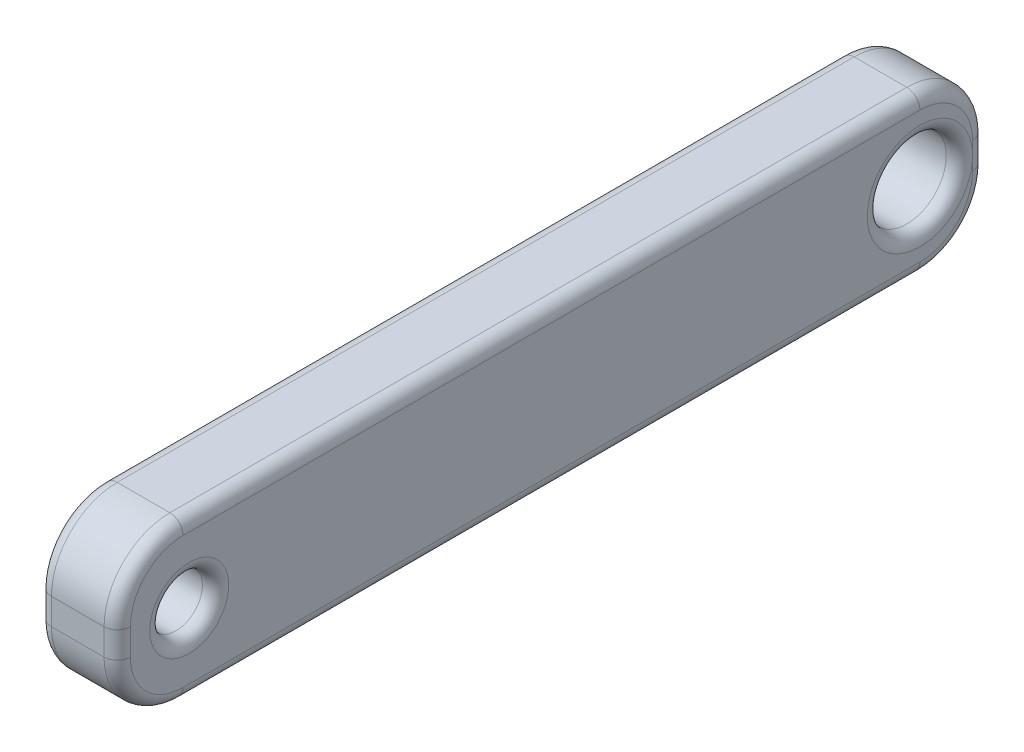
ISO-10303-21;
HEADER;
FILE_DESCRIPTION(('STEP AP214'),'2;1');
FILE_NAME('part.step','',(''),(''),'','','');
FILE_SCHEMA(('AUTOMOTIVE_DESIGN { 1 0 10303 214 1 1 1 1 }'));
ENDSEC;
DATA;
#1=APPLICATION_CONTEXT('core data for automotive mechanical design processes');
#2=APPLICATION_PROTOCOL_DEFINITION('international standard','automotive_design',2000,#1);
#3=PRODUCT_CONTEXT('',#1,'mechanical');
#4=PRODUCT('Part','Part','',(#3));
#5=PRODUCT_RELATED_PRODUCT_CATEGORY('part','',(#4));
#6=PRODUCT_DEFINITION_FORMATION('','',#4);
#7=PRODUCT_DEFINITION_CONTEXT('part definition',#1,'design');
#8=PRODUCT_DEFINITION('design','',#6,#7);
#9=PRODUCT_DEFINITION_SHAPE('','',#8);
#10=(LENGTH_UNIT() NAMED_UNIT(*) SI_UNIT(.MILLI.,.METRE.));
#11=(NAMED_UNIT(*) PLANE_ANGLE_UNIT() SI_UNIT($,.RADIAN.));
#12=(NAMED_UNIT(*) SI_UNIT($,.STERADIAN.) SOLID_ANGLE_UNIT());
#13=UNCERTAINTY_MEASURE_WITH_UNIT(LENGTH_MEASURE(1.E-05),#10,'distance_accuracy_value','');
#14=(GEOMETRIC_REPRESENTATION_CONTEXT(3) GLOBAL_UNCERTAINTY_ASSIGNED_CONTEXT((#13)) GLOBAL_UNIT_ASSIGNED_CONTEXT((#10,
#11,#12)) REPRESENTATION_CONTEXT('',''));
#15=CARTESIAN_POINT('',(0.,0.,0.));
#16=DIRECTION('',(0.,0.,1.));
#17=DIRECTION('',(1.,0.,0.));
#18=AXIS2_PLACEMENT_3D('',#15,#16,#17);
#19=CARTESIAN_POINT('',(3.,3.5,-30.5));
#20=DIRECTION('',(1.,0.,0.));
#21=DIRECTION('',(0.,0.,-1.));
#22=AXIS2_PLACEMENT_3D('',#19,#20,#21);
#23=PLANE('',#22);
#24=CARTESIAN_POINT('',(3.,3.,-2.73587532026645));
#25=DIRECTION('',(1.,0.,0.));
#26=DIRECTION('',(0.,0.,-1.));
#27=AXIS2_PLACEMENT_3D('',#24,#25,#26);
#28=CIRCLE('',#27,1.5);
#29=CARTESIAN_POINT('',(3.,3.,-4.23587532026645));
#30=VERTEX_POINT('',#29);
#31=EDGE_CURVE('E11',#30,#30,#28,.F.);
#32=ORIENTED_EDGE('',*,*,#31,.T.);
#33=EDGE_LOOP('',(#32));
#34=FACE_BOUND('',#33,.T.);
#35=CARTESIAN_POINT('',(3.,2.5,-30.5));
#36=DIRECTION('',(1.,0.,0.));
#37=DIRECTION('',(0.,0.,-1.));
#38=AXIS2_PLACEMENT_3D('',#35,#36,#37);
#39=CIRCLE('',#38,2.);
#40=CARTESIAN_POINT('',(3.,0.5,-30.5));
#41=VERTEX_POINT('',#40);
#42=CARTESIAN_POINT('',(3.,2.5,-32.5));
#43=VERTEX_POINT('',#42);
#44=EDGE_CURVE('E50',#41,#43,#39,.T.);
#45=ORIENTED_EDGE('',*,*,#44,.T.);
#46=DIRECTION('',(0.,1.,0.));
#47=VECTOR('',#46,1.);
#48=CARTESIAN_POINT('',(3.,3.5,-32.5));
#49=LINE('',#48,#47);
#50=CARTESIAN_POINT('',(3.,3.,-32.5));
#51=VERTEX_POINT('',#50);
#52=EDGE_CURVE('E42',#43,#51,#49,.T.);
#53=ORIENTED_EDGE('',*,*,#52,.T.);
#54=CARTESIAN_POINT('',(3.,3.,-30.5));
#55=DIRECTION('',(1.,0.,0.));
#56=DIRECTION('',(0.,0.,-1.));
#57=AXIS2_PLACEMENT_3D('',#54,#55,#56);
#58=CIRCLE('',#57,2.);
#59=EDGE_CURVE('E248',#51,#51,#58,.F.);
#60=ORIENTED_EDGE('',*,*,#59,.T.);
#61=DIRECTION('',(0.,1.,0.));
#62=VECTOR('',#61,1.);
#63=CARTESIAN_POINT('',(3.,3.5,-32.5));
#64=LINE('',#63,#62);
#65=CARTESIAN_POINT('',(3.,3.5,-32.5));
#66=VERTEX_POINT('',#65);
#67=EDGE_CURVE('E251',#51,#66,#64,.T.);
#68=ORIENTED_EDGE('',*,*,#67,.T.);
#69=CARTESIAN_POINT('',(3.,3.5,-30.5));
#70=DIRECTION('',(1.,0.,0.));
#71=DIRECTION('',(0.,0.,-1.));
#72=AXIS2_PLACEMENT_3D('',#69,#70,#71);
#73=CIRCLE('',#72,2.);
#74=CARTESIAN_POINT('',(3.,5.5,-30.5));
#75=VERTEX_POINT('',#74);
#76=EDGE_CURVE('E253',#66,#75,#73,.T.);
#77=ORIENTED_EDGE('',*,*,#76,.T.);
#78=DIRECTION('',(0.,0.,1.));
#79=VECTOR('',#78,1.);
#80=CARTESIAN_POINT('',(3.,5.5,-2.50000000000002));
#81=LINE('',#80,#79);
#82=CARTESIAN_POINT('',(3.,5.5,-2.50000000000001));
#83=VERTEX_POINT('',#82);
#84=EDGE_CURVE('E255',#75,#83,#81,.T.);
#85=ORIENTED_EDGE('',*,*,#84,.T.);
#86=CARTESIAN_POINT('',(3.,3.5,-2.5));
#87=DIRECTION('',(1.,0.,0.));
#88=DIRECTION('',(0.,0.,-1.));
#89=AXIS2_PLACEMENT_3D('',#86,#87,#88);
#90=CIRCLE('',#89,2.);
#91=CARTESIAN_POINT('',(3.,3.49999999999998,-0.5));
#92=VERTEX_POINT('',#91);
#93=EDGE_CURVE('E257',#83,#92,#90,.T.);
#94=ORIENTED_EDGE('',*,*,#93,.T.);
#95=DIRECTION('',(0.,-1.,0.));
#96=VECTOR('',#95,1.);
#97=CARTESIAN_POINT('',(3.,2.50000000000002,-0.5));
#98=LINE('',#97,#96);
#99=CARTESIAN_POINT('',(3.,2.50000000000001,-0.5));
#100=VERTEX_POINT('',#99);
#101=EDGE_CURVE('E259',#92,#100,#98,.T.);
#102=ORIENTED_EDGE('',*,*,#101,.T.);
#103=CARTESIAN_POINT('',(3.,2.5,-2.5));
#104=DIRECTION('',(1.,0.,0.));
#105=DIRECTION('',(0.,0.,-1.));
#106=AXIS2_PLACEMENT_3D('',#103,#104,#105);
#107=CIRCLE('',#106,2.);
#108=CARTESIAN_POINT('',(3.,0.5,-2.50000000000002));
#109=VERTEX_POINT('',#108);
#110=EDGE_CURVE('E261',#100,#109,#107,.T.);
#111=ORIENTED_EDGE('',*,*,#110,.T.);
#112=DIRECTION('',(0.,0.,-1.));
#113=VECTOR('',#112,1.);
#114=CARTESIAN_POINT('',(3.,0.5,-30.5));
#115=LINE('',#114,#113);
#116=EDGE_CURVE('E55',#109,#41,#115,.T.);
#117=ORIENTED_EDGE('',*,*,#116,.T.);
#118=EDGE_LOOP('',(#45,#53,#60,#68,#77,#85,#94,#102,#111,#117));
#119=FACE_BOUND('',#118,.T.);
#120=ADVANCED_FACE('F33',(#34,#119),#23,.T.);
#121=CARTESIAN_POINT('',(0.,3.5,-30.5));
#122=DIRECTION('',(1.,0.,0.));
#123=DIRECTION('',(0.,0.,-1.));
#124=AXIS2_PLACEMENT_3D('',#121,#122,#123);
#125=PLANE('',#124);
#126=CARTESIAN_POINT('',(0.,3.,-2.73587532026645));
#127=DIRECTION('',(1.,0.,0.));
#128=DIRECTION('',(0.,0.,-1.));
#129=AXIS2_PLACEMENT_3D('',#126,#127,#128);
#130=CIRCLE('',#129,1.5);
#131=CARTESIAN_POINT('',(0.,3.,-4.23587532026645));
#132=VERTEX_POINT('',#131);
#133=EDGE_CURVE('E175',#132,#132,#130,.T.);
#134=ORIENTED_EDGE('',*,*,#133,.T.);
#135=EDGE_LOOP('',(#134));
#136=FACE_BOUND('',#135,.T.);
#137=CARTESIAN_POINT('',(0.,3.5,-30.5));
#138=DIRECTION('',(1.,0.,0.));
#139=DIRECTION('',(0.,0.,-1.));
#140=AXIS2_PLACEMENT_3D('',#137,#138,#139);
#141=CIRCLE('',#140,2.);
#142=CARTESIAN_POINT('',(0.,5.5,-30.5));
#143=VERTEX_POINT('',#142);
#144=CARTESIAN_POINT('',(0.,3.5,-32.5));
#145=VERTEX_POINT('',#144);
#146=EDGE_CURVE('E170',#143,#145,#141,.F.);
#147=ORIENTED_EDGE('',*,*,#146,.T.);
#148=DIRECTION('',(0.,1.,0.));
#149=VECTOR('',#148,1.);
#150=CARTESIAN_POINT('',(0.,3.5,-32.5));
#151=LINE('',#150,#149);
#152=CARTESIAN_POINT('',(0.,3.,-32.5));
#153=VERTEX_POINT('',#152);
#154=EDGE_CURVE('E166',#145,#153,#151,.F.);
#155=ORIENTED_EDGE('',*,*,#154,.T.);
#156=CARTESIAN_POINT('',(0.,3.,-30.5));
#157=DIRECTION('',(1.,0.,0.));
#158=DIRECTION('',(0.,0.,-1.));
#159=AXIS2_PLACEMENT_3D('',#156,#157,#158);
#160=CIRCLE('',#159,2.);
#161=CARTESIAN_POINT('',(0.,3.,-28.5));
#162=VERTEX_POINT('',#161);
#163=EDGE_CURVE('E156',#153,#162,#160,.T.);
#164=ORIENTED_EDGE('',*,*,#163,.T.);
#165=CARTESIAN_POINT('',(0.,3.,-30.5));
#166=DIRECTION('',(1.,0.,0.));
#167=DIRECTION('',(0.,0.,-1.));
#168=AXIS2_PLACEMENT_3D('',#165,#166,#167);
#169=CIRCLE('',#168,2.);
#170=EDGE_CURVE('E161',#162,#153,#169,.T.);
#171=ORIENTED_EDGE('',*,*,#170,.T.);
#172=DIRECTION('',(0.,1.,0.));
#173=VECTOR('',#172,1.);
#174=CARTESIAN_POINT('',(0.,3.5,-32.5));
#175=LINE('',#174,#173);
#176=CARTESIAN_POINT('',(0.,2.5,-32.5));
#177=VERTEX_POINT('',#176);
#178=EDGE_CURVE('E177',#153,#177,#175,.F.);
#179=ORIENTED_EDGE('',*,*,#178,.T.);
#180=CARTESIAN_POINT('',(0.,2.5,-30.5));
#181=DIRECTION('',(1.,0.,0.));
#182=DIRECTION('',(0.,0.,-1.));
#183=AXIS2_PLACEMENT_3D('',#180,#181,#182);
#184=CIRCLE('',#183,2.);
#185=CARTESIAN_POINT('',(0.,0.499999999999999,-30.5));
#186=VERTEX_POINT('',#185);
#187=EDGE_CURVE('E185',#177,#186,#184,.F.);
#188=ORIENTED_EDGE('',*,*,#187,.T.);
#189=DIRECTION('',(0.,0.,-1.));
#190=VECTOR('',#189,1.);
#191=CARTESIAN_POINT('',(0.,0.5,-30.5));
#192=LINE('',#191,#190);
#193=CARTESIAN_POINT('',(0.,0.5,-2.50000000000001));
#194=VERTEX_POINT('',#193);
#195=EDGE_CURVE('E187',#186,#194,#192,.F.);
#196=ORIENTED_EDGE('',*,*,#195,.T.);
#197=CARTESIAN_POINT('',(0.,2.5,-2.5));
#198=DIRECTION('',(1.,0.,0.));
#199=DIRECTION('',(0.,0.,-1.));
#200=AXIS2_PLACEMENT_3D('',#197,#198,#199);
#201=CIRCLE('',#200,2.);
#202=CARTESIAN_POINT('',(0.,2.50000000000002,-0.5));
#203=VERTEX_POINT('',#202);
#204=EDGE_CURVE('E191',#194,#203,#201,.F.);
#205=ORIENTED_EDGE('',*,*,#204,.T.);
#206=DIRECTION('',(0.,-1.,0.));
#207=VECTOR('',#206,1.);
#208=CARTESIAN_POINT('',(0.,3.5,-0.5));
#209=LINE('',#208,#207);
#210=CARTESIAN_POINT('',(0.,3.49999999999999,-0.5));
#211=VERTEX_POINT('',#210);
#212=EDGE_CURVE('E193',#203,#211,#209,.F.);
#213=ORIENTED_EDGE('',*,*,#212,.T.);
#214=CARTESIAN_POINT('',(0.,3.5,-2.5));
#215=DIRECTION('',(1.,0.,0.));
#216=DIRECTION('',(0.,0.,-1.));
#217=AXIS2_PLACEMENT_3D('',#214,#215,#216);
#218=CIRCLE('',#217,2.);
#219=CARTESIAN_POINT('',(0.,5.5,-2.50000000000002));
#220=VERTEX_POINT('',#219);
#221=EDGE_CURVE('E195',#211,#220,#218,.F.);
#222=ORIENTED_EDGE('',*,*,#221,.T.);
#223=DIRECTION('',(0.,0.,1.));
#224=VECTOR('',#223,1.);
#225=CARTESIAN_POINT('',(0.,5.5,-30.5));
#226=LINE('',#225,#224);
#227=EDGE_CURVE('E197',#220,#143,#226,.F.);
#228=ORIENTED_EDGE('',*,*,#227,.T.);
#229=EDGE_LOOP('',(#147,#155,#164,#171,#179,#188,#196,#205,#213,#222,#228));
#230=FACE_BOUND('',#229,.T.);
#231=ADVANCED_FACE('F167',(#136,#230),#125,.F.);
#232=CARTESIAN_POINT('',(3.,3.5,-30.5));
#233=DIRECTION('',(-1.,0.,0.));
#234=DIRECTION('',(0.,0.,1.));
#235=AXIS2_PLACEMENT_3D('',#232,#233,#234);
#236=CYLINDRICAL_SURFACE('',#235,2.5);
#237=DIRECTION('',(-1.,0.,0.));
#238=VECTOR('',#237,1.);
#239=CARTESIAN_POINT('',(3.,3.5,-33.));
#240=LINE('',#239,#238);
#241=CARTESIAN_POINT('',(2.5,3.5,-33.));
#242=VERTEX_POINT('',#241);
#243=CARTESIAN_POINT('',(0.5,3.5,-33.));
#244=VERTEX_POINT('',#243);
#245=EDGE_CURVE('E285',#242,#244,#240,.T.);
#246=ORIENTED_EDGE('',*,*,#245,.T.);
#247=CARTESIAN_POINT('',(0.5,3.5,-30.5));
#248=DIRECTION('',(1.,0.,0.));
#249=DIRECTION('',(0.,0.,-1.));
#250=AXIS2_PLACEMENT_3D('',#247,#248,#249);
#251=CIRCLE('',#250,2.5);
#252=CARTESIAN_POINT('',(0.5,6.,-30.5));
#253=VERTEX_POINT('',#252);
#254=EDGE_CURVE('E240',#244,#253,#251,.T.);
#255=ORIENTED_EDGE('',*,*,#254,.T.);
#256=DIRECTION('',(-1.,0.,0.));
#257=VECTOR('',#256,1.);
#258=CARTESIAN_POINT('',(3.,6.,-30.5));
#259=LINE('',#258,#257);
#260=CARTESIAN_POINT('',(2.5,6.,-30.5));
#261=VERTEX_POINT('',#260);
#262=EDGE_CURVE('E163',#261,#253,#259,.T.);
#263=ORIENTED_EDGE('',*,*,#262,.F.);
#264=CARTESIAN_POINT('',(2.5,3.5,-30.5));
#265=DIRECTION('',(1.,0.,0.));
#266=DIRECTION('',(0.,0.,-1.));
#267=AXIS2_PLACEMENT_3D('',#264,#265,#266);
#268=CIRCLE('',#267,2.5);
#269=EDGE_CURVE('E238',#261,#242,#268,.F.);
#270=ORIENTED_EDGE('',*,*,#269,.T.);
#271=EDGE_LOOP('',(#246,#255,#263,#270));
#272=FACE_BOUND('',#271,.T.);
#273=ADVANCED_FACE('F396',(#272),#236,.T.);
#274=CARTESIAN_POINT('',(3.,6.,-2.50000000000002));
#275=DIRECTION('',(0.,-1.,0.));
#276=DIRECTION('',(0.,0.,-1.));
#277=AXIS2_PLACEMENT_3D('',#274,#275,#276);
#278=PLANE('',#277);
#279=ORIENTED_EDGE('',*,*,#262,.T.);
#280=DIRECTION('',(0.,0.,1.));
#281=VECTOR('',#280,1.);
#282=CARTESIAN_POINT('',(0.5,6.,-2.50000000000002));
#283=LINE('',#282,#281);
#284=CARTESIAN_POINT('',(0.5,6.,-2.50000000000002));
#285=VERTEX_POINT('',#284);
#286=EDGE_CURVE('E210',#253,#285,#283,.T.);
#287=ORIENTED_EDGE('',*,*,#286,.T.);
#288=DIRECTION('',(-1.,0.,0.));
#289=VECTOR('',#288,1.);
#290=CARTESIAN_POINT('',(3.,6.,-2.50000000000002));
#291=LINE('',#290,#289);
#292=CARTESIAN_POINT('',(2.5,6.,-2.50000000000002));
#293=VERTEX_POINT('',#292);
#294=EDGE_CURVE('E333',#293,#285,#291,.T.);
#295=ORIENTED_EDGE('',*,*,#294,.F.);
#296=DIRECTION('',(0.,0.,1.));
#297=VECTOR('',#296,1.);
#298=CARTESIAN_POINT('',(2.5,6.,-30.5));
#299=LINE('',#298,#297);
#300=EDGE_CURVE('E208',#293,#261,#299,.F.);
#301=ORIENTED_EDGE('',*,*,#300,.T.);
#302=EDGE_LOOP('',(#279,#287,#295,#301));
#303=FACE_BOUND('',#302,.T.);
#304=ADVANCED_FACE('F344',(#303),#278,.F.);
#305=CARTESIAN_POINT('',(3.,3.5,-2.5));
#306=DIRECTION('',(-1.,0.,0.));
#307=DIRECTION('',(0.,0.,1.));
#308=AXIS2_PLACEMENT_3D('',#305,#306,#307);
#309=CYLINDRICAL_SURFACE('',#308,2.5);
#310=ORIENTED_EDGE('',*,*,#294,.T.);
#311=CARTESIAN_POINT('',(0.5,3.5,-2.5));
#312=DIRECTION('',(1.,0.,0.));
#313=DIRECTION('',(0.,0.,-1.));
#314=AXIS2_PLACEMENT_3D('',#311,#312,#313);
#315=CIRCLE('',#314,2.5);
#316=CARTESIAN_POINT('',(0.5,3.49999999999998,0.));
#317=VERTEX_POINT('',#316);
#318=EDGE_CURVE('E215',#285,#317,#315,.T.);
#319=ORIENTED_EDGE('',*,*,#318,.T.);
#320=DIRECTION('',(-1.,0.,0.));
#321=VECTOR('',#320,1.);
#322=CARTESIAN_POINT('',(3.,3.49999999999998,0.));
#323=LINE('',#322,#321);
#324=CARTESIAN_POINT('',(2.5,3.49999999999998,0.));
#325=VERTEX_POINT('',#324);
#326=EDGE_CURVE('E324',#325,#317,#323,.T.);
#327=ORIENTED_EDGE('',*,*,#326,.F.);
#328=CARTESIAN_POINT('',(2.5,3.5,-2.5));
#329=DIRECTION('',(1.,0.,0.));
#330=DIRECTION('',(0.,0.,-1.));
#331=AXIS2_PLACEMENT_3D('',#328,#329,#330);
#332=CIRCLE('',#331,2.5);
#333=EDGE_CURVE('E213',#325,#293,#332,.F.);
#334=ORIENTED_EDGE('',*,*,#333,.T.);
#335=EDGE_LOOP('',(#310,#319,#327,#334));
#336=FACE_BOUND('',#335,.T.);
#337=ADVANCED_FACE('F330',(#336),#309,.T.);
#338=CARTESIAN_POINT('',(3.,2.50000000000002,0.));
#339=DIRECTION('',(0.,0.,-1.));
#340=DIRECTION('',(-1.,0.,0.));
#341=AXIS2_PLACEMENT_3D('',#338,#339,#340);
#342=PLANE('',#341);
#343=ORIENTED_EDGE('',*,*,#326,.T.);
#344=DIRECTION('',(0.,-1.,0.));
#345=VECTOR('',#344,1.);
#346=CARTESIAN_POINT('',(0.5,2.50000000000002,0.));
#347=LINE('',#346,#345);
#348=CARTESIAN_POINT('',(0.5,2.50000000000002,0.));
#349=VERTEX_POINT('',#348);
#350=EDGE_CURVE('E219',#317,#349,#347,.T.);
#351=ORIENTED_EDGE('',*,*,#350,.T.);
#352=DIRECTION('',(-1.,0.,0.));
#353=VECTOR('',#352,1.);
#354=CARTESIAN_POINT('',(3.,2.50000000000002,0.));
#355=LINE('',#354,#353);
#356=CARTESIAN_POINT('',(2.5,2.50000000000002,0.));
#357=VERTEX_POINT('',#356);
#358=EDGE_CURVE('E327',#357,#349,#355,.T.);
#359=ORIENTED_EDGE('',*,*,#358,.F.);
#360=DIRECTION('',(0.,-1.,0.));
#361=VECTOR('',#360,1.);
#362=CARTESIAN_POINT('',(2.5,3.49999999999998,0.));
#363=LINE('',#362,#361);
#364=EDGE_CURVE('E217',#357,#325,#363,.F.);
#365=ORIENTED_EDGE('',*,*,#364,.T.);
#366=EDGE_LOOP('',(#343,#351,#359,#365));
#367=FACE_BOUND('',#366,.T.);
#368=ADVANCED_FACE('F323',(#367),#342,.F.);
#369=CARTESIAN_POINT('',(3.,2.5,-2.5));
#370=DIRECTION('',(-1.,0.,0.));
#371=DIRECTION('',(0.,0.,1.));
#372=AXIS2_PLACEMENT_3D('',#369,#370,#371);
#373=CYLINDRICAL_SURFACE('',#372,2.5);
#374=ORIENTED_EDGE('',*,*,#358,.T.);
#375=CARTESIAN_POINT('',(0.5,2.5,-2.5));
#376=DIRECTION('',(1.,0.,0.));
#377=DIRECTION('',(0.,0.,-1.));
#378=AXIS2_PLACEMENT_3D('',#375,#376,#377);
#379=CIRCLE('',#378,2.5);
#380=CARTESIAN_POINT('',(0.5,0.,-2.50000000000002));
#381=VERTEX_POINT('',#380);
#382=EDGE_CURVE('E223',#349,#381,#379,.T.);
#383=ORIENTED_EDGE('',*,*,#382,.T.);
#384=DIRECTION('',(-1.,0.,0.));
#385=VECTOR('',#384,1.);
#386=CARTESIAN_POINT('',(3.,0.,-2.50000000000002));
#387=LINE('',#386,#385);
#388=CARTESIAN_POINT('',(2.5,0.,-2.50000000000002));
#389=VERTEX_POINT('',#388);
#390=EDGE_CURVE('E336',#389,#381,#387,.T.);
#391=ORIENTED_EDGE('',*,*,#390,.F.);
#392=CARTESIAN_POINT('',(2.5,2.5,-2.5));
#393=DIRECTION('',(1.,0.,0.));
#394=DIRECTION('',(0.,0.,-1.));
#395=AXIS2_PLACEMENT_3D('',#392,#393,#394);
#396=CIRCLE('',#395,2.5);
#397=EDGE_CURVE('E221',#389,#357,#396,.F.);
#398=ORIENTED_EDGE('',*,*,#397,.T.);
#399=EDGE_LOOP('',(#374,#383,#391,#398));
#400=FACE_BOUND('',#399,.T.);
#401=ADVANCED_FACE('F366',(#400),#373,.T.);
#402=CARTESIAN_POINT('',(3.,0.,-2.50000000000002));
#403=DIRECTION('',(0.,1.,0.));
#404=DIRECTION('',(0.,0.,1.));
#405=AXIS2_PLACEMENT_3D('',#402,#403,#404);
#406=PLANE('',#405);
#407=ORIENTED_EDGE('',*,*,#390,.T.);
#408=DIRECTION('',(0.,0.,-1.));
#409=VECTOR('',#408,1.);
#410=CARTESIAN_POINT('',(0.5,0.,-2.50000000000002));
#411=LINE('',#410,#409);
#412=CARTESIAN_POINT('',(0.5,0.,-30.5));
#413=VERTEX_POINT('',#412);
#414=EDGE_CURVE('E227',#381,#413,#411,.T.);
#415=ORIENTED_EDGE('',*,*,#414,.T.);
#416=DIRECTION('',(-1.,0.,0.));
#417=VECTOR('',#416,1.);
#418=CARTESIAN_POINT('',(3.,0.,-30.5));
#419=LINE('',#418,#417);
#420=CARTESIAN_POINT('',(2.5,0.,-30.5));
#421=VERTEX_POINT('',#420);
#422=EDGE_CURVE('E383',#421,#413,#419,.T.);
#423=ORIENTED_EDGE('',*,*,#422,.F.);
#424=DIRECTION('',(0.,0.,-1.));
#425=VECTOR('',#424,1.);
#426=CARTESIAN_POINT('',(2.5,0.,-2.50000000000002));
#427=LINE('',#426,#425);
#428=EDGE_CURVE('E225',#421,#389,#427,.F.);
#429=ORIENTED_EDGE('',*,*,#428,.T.);
#430=EDGE_LOOP('',(#407,#415,#423,#429));
#431=FACE_BOUND('',#430,.T.);
#432=ADVANCED_FACE('F382',(#431),#406,.F.);
#433=CARTESIAN_POINT('',(3.,2.5,-30.5));
#434=DIRECTION('',(-1.,0.,0.));
#435=DIRECTION('',(0.,0.,1.));
#436=AXIS2_PLACEMENT_3D('',#433,#434,#435);
#437=CYLINDRICAL_SURFACE('',#436,2.5);
#438=ORIENTED_EDGE('',*,*,#422,.T.);
#439=CARTESIAN_POINT('',(0.5,2.5,-30.5));
#440=DIRECTION('',(1.,0.,0.));
#441=DIRECTION('',(0.,0.,-1.));
#442=AXIS2_PLACEMENT_3D('',#439,#440,#441);
#443=CIRCLE('',#442,2.5);
#444=CARTESIAN_POINT('',(0.5,2.5,-33.));
#445=VERTEX_POINT('',#444);
#446=EDGE_CURVE('E231',#413,#445,#443,.T.);
#447=ORIENTED_EDGE('',*,*,#446,.T.);
#448=DIRECTION('',(-1.,0.,0.));
#449=VECTOR('',#448,1.);
#450=CARTESIAN_POINT('',(3.,2.5,-33.));
#451=LINE('',#450,#449);
#452=CARTESIAN_POINT('',(2.5,2.5,-33.));
#453=VERTEX_POINT('',#452);
#454=EDGE_CURVE('E390',#453,#445,#451,.T.);
#455=ORIENTED_EDGE('',*,*,#454,.F.);
#456=CARTESIAN_POINT('',(2.5,2.5,-30.5));
#457=DIRECTION('',(1.,0.,0.));
#458=DIRECTION('',(0.,0.,-1.));
#459=AXIS2_PLACEMENT_3D('',#456,#457,#458);
#460=CIRCLE('',#459,2.5);
#461=EDGE_CURVE('E229',#453,#421,#460,.F.);
#462=ORIENTED_EDGE('',*,*,#461,.T.);
#463=EDGE_LOOP('',(#438,#447,#455,#462));
#464=FACE_BOUND('',#463,.T.);
#465=ADVANCED_FACE('F386',(#464),#437,.T.);
#466=CARTESIAN_POINT('',(3.,2.5,-33.));
#467=DIRECTION('',(0.,0.,1.));
#468=DIRECTION('',(1.,0.,0.));
#469=AXIS2_PLACEMENT_3D('',#466,#467,#468);
#470=PLANE('',#469);
#471=ORIENTED_EDGE('',*,*,#454,.T.);
#472=DIRECTION('',(0.,1.,0.));
#473=VECTOR('',#472,1.);
#474=CARTESIAN_POINT('',(0.5,2.5,-33.));
#475=LINE('',#474,#473);
#476=EDGE_CURVE('E236',#445,#244,#475,.T.);
#477=ORIENTED_EDGE('',*,*,#476,.T.);
#478=ORIENTED_EDGE('',*,*,#245,.F.);
#479=DIRECTION('',(0.,1.,0.));
#480=VECTOR('',#479,1.);
#481=CARTESIAN_POINT('',(2.5,2.5,-33.));
#482=LINE('',#481,#480);
#483=EDGE_CURVE('E233',#242,#453,#482,.F.);
#484=ORIENTED_EDGE('',*,*,#483,.T.);
#485=EDGE_LOOP('',(#471,#477,#478,#484));
#486=FACE_BOUND('',#485,.T.);
#487=ADVANCED_FACE('F400',(#486),#470,.F.);
#488=CARTESIAN_POINT('',(3.,3.,-2.73587532026645));
#489=DIRECTION('',(-1.,0.,0.));
#490=DIRECTION('',(0.,0.,1.));
#491=AXIS2_PLACEMENT_3D('',#488,#489,#490);
#492=CYLINDRICAL_SURFACE('',#491,1.);
#493=CARTESIAN_POINT('',(0.5,3.,-2.73587532026645));
#494=DIRECTION('',(1.,0.,0.));
#495=DIRECTION('',(0.,0.,-1.));
#496=AXIS2_PLACEMENT_3D('',#493,#494,#495);
#497=CIRCLE('',#496,1.);
#498=CARTESIAN_POINT('',(0.5,3.,-3.73587532026645));
#499=VERTEX_POINT('',#498);
#500=EDGE_CURVE('E205',#499,#499,#497,.F.);
#501=ORIENTED_EDGE('',*,*,#500,.T.);
#502=EDGE_LOOP('',(#501));
#503=FACE_BOUND('',#502,.T.);
#504=CARTESIAN_POINT('',(2.5,3.,-2.73587532026645));
#505=DIRECTION('',(1.,0.,0.));
#506=DIRECTION('',(0.,0.,-1.));
#507=AXIS2_PLACEMENT_3D('',#504,#505,#506);
#508=CIRCLE('',#507,1.);
#509=CARTESIAN_POINT('',(2.5,3.,-3.73587532026645));
#510=VERTEX_POINT('',#509);
#511=EDGE_CURVE('E202',#510,#510,#508,.T.);
#512=ORIENTED_EDGE('',*,*,#511,.T.);
#513=EDGE_LOOP('',(#512));
#514=FACE_BOUND('',#513,.T.);
#515=ADVANCED_FACE('F421',(#503,#514),#492,.F.);
#516=CARTESIAN_POINT('',(10.,3.,-30.5));
#517=DIRECTION('',(-1.,0.,0.));
#518=DIRECTION('',(0.,0.,1.));
#519=AXIS2_PLACEMENT_3D('',#516,#517,#518);
#520=CYLINDRICAL_SURFACE('',#519,1.5);
#521=CARTESIAN_POINT('',(0.5,3.,-30.5));
#522=DIRECTION('',(1.,0.,0.));
#523=DIRECTION('',(0.,0.,-1.));
#524=AXIS2_PLACEMENT_3D('',#521,#522,#523);
#525=CIRCLE('',#524,1.5);
#526=CARTESIAN_POINT('',(0.5,3.,-32.));
#527=VERTEX_POINT('',#526);
#528=EDGE_CURVE('E245',#527,#527,#525,.F.);
#529=ORIENTED_EDGE('',*,*,#528,.T.);
#530=EDGE_LOOP('',(#529));
#531=FACE_BOUND('',#530,.T.);
#532=CARTESIAN_POINT('',(2.5,3.,-30.5));
#533=DIRECTION('',(1.,0.,0.));
#534=DIRECTION('',(0.,0.,-1.));
#535=AXIS2_PLACEMENT_3D('',#532,#533,#534);
#536=CIRCLE('',#535,1.5);
#537=CARTESIAN_POINT('',(2.5,3.,-32.));
#538=VERTEX_POINT('',#537);
#539=EDGE_CURVE('E242',#538,#538,#536,.T.);
#540=ORIENTED_EDGE('',*,*,#539,.T.);
#541=EDGE_LOOP('',(#540));
#542=FACE_BOUND('',#541,.T.);
#543=ADVANCED_FACE('F442',(#531,#542),#520,.F.);
#544=CARTESIAN_POINT('',(0.5,3.,-2.73587532026645));
#545=DIRECTION('',(1.,0.,0.));
#546=DIRECTION('',(0.,0.,-1.));
#547=AXIS2_PLACEMENT_3D('',#544,#545,#546);
#548=TOROIDAL_SURFACE('',#547,1.5,0.5);
#549=ORIENTED_EDGE('',*,*,#500,.F.);
#550=EDGE_LOOP('',(#549));
#551=FACE_BOUND('',#550,.T.);
#552=ORIENTED_EDGE('',*,*,#133,.F.);
#553=EDGE_LOOP('',(#552));
#554=FACE_BOUND('',#553,.T.);
#555=ADVANCED_FACE('F410',(#551,#554),#548,.T.);
#556=CARTESIAN_POINT('',(0.5,0.5,-2.50000000000002));
#557=DIRECTION('',(0.,0.,-1.));
#558=DIRECTION('',(-1.,0.,0.));
#559=AXIS2_PLACEMENT_3D('',#556,#557,#558);
#560=CYLINDRICAL_SURFACE('',#559,0.5);
#561=CARTESIAN_POINT('',(0.5,0.5,-2.50000000000001));
#562=DIRECTION('',(0.,0.,1.));
#563=DIRECTION('',(0.,-1.,0.));
#564=AXIS2_PLACEMENT_3D('',#561,#562,#563);
#565=CIRCLE('',#564,0.5);
#566=EDGE_CURVE('E279',#194,#381,#565,.T.);
#567=ORIENTED_EDGE('',*,*,#566,.F.);
#568=ORIENTED_EDGE('',*,*,#195,.F.);
#569=CARTESIAN_POINT('',(0.5,0.5,-30.5));
#570=DIRECTION('',(0.,0.,-1.));
#571=DIRECTION('',(-1.,0.,0.));
#572=AXIS2_PLACEMENT_3D('',#569,#570,#571);
#573=CIRCLE('',#572,0.5);
#574=EDGE_CURVE('E282',#413,#186,#573,.T.);
#575=ORIENTED_EDGE('',*,*,#574,.F.);
#576=ORIENTED_EDGE('',*,*,#414,.F.);
#577=EDGE_LOOP('',(#567,#568,#575,#576));
#578=FACE_BOUND('',#577,.T.);
#579=ADVANCED_FACE('F376',(#578),#560,.T.);
#580=CARTESIAN_POINT('',(0.5,2.5,-30.5));
#581=DIRECTION('',(1.,0.,0.));
#582=DIRECTION('',(0.,0.,-1.));
#583=AXIS2_PLACEMENT_3D('',#580,#581,#582);
#584=TOROIDAL_SURFACE('',#583,2.,0.5);
#585=ORIENTED_EDGE('',*,*,#574,.T.);
#586=ORIENTED_EDGE('',*,*,#187,.F.);
#587=CARTESIAN_POINT('',(0.5,2.5,-32.5));
#588=DIRECTION('',(0.,1.,0.));
#589=DIRECTION('',(0.,0.,1.));
#590=AXIS2_PLACEMENT_3D('',#587,#588,#589);
#591=CIRCLE('',#590,0.5);
#592=EDGE_CURVE('E184',#445,#177,#591,.T.);
#593=ORIENTED_EDGE('',*,*,#592,.F.);
#594=ORIENTED_EDGE('',*,*,#446,.F.);
#595=EDGE_LOOP('',(#585,#586,#593,#594));
#596=FACE_BOUND('',#595,.T.);
#597=ADVANCED_FACE('F402',(#596),#584,.T.);
#598=CARTESIAN_POINT('',(0.5,2.5,-2.5));
#599=DIRECTION('',(1.,0.,0.));
#600=DIRECTION('',(0.,0.,-1.));
#601=AXIS2_PLACEMENT_3D('',#598,#599,#600);
#602=TOROIDAL_SURFACE('',#601,2.,0.5);
#603=ORIENTED_EDGE('',*,*,#566,.T.);
#604=ORIENTED_EDGE('',*,*,#382,.F.);
#605=CARTESIAN_POINT('',(0.5,2.50000000000002,-0.5));
#606=DIRECTION('',(0.,1.,0.));
#607=DIRECTION('',(0.,0.,1.));
#608=AXIS2_PLACEMENT_3D('',#605,#606,#607);
#609=CIRCLE('',#608,0.5);
#610=EDGE_CURVE('E275',#203,#349,#609,.T.);
#611=ORIENTED_EDGE('',*,*,#610,.F.);
#612=ORIENTED_EDGE('',*,*,#204,.F.);
#613=EDGE_LOOP('',(#603,#604,#611,#612));
#614=FACE_BOUND('',#613,.T.);
#615=ADVANCED_FACE('F370',(#614),#602,.T.);
#616=CARTESIAN_POINT('',(0.5,2.5,-32.5));
#617=DIRECTION('',(0.,1.,0.));
#618=DIRECTION('',(0.,0.,1.));
#619=AXIS2_PLACEMENT_3D('',#616,#617,#618);
#620=CYLINDRICAL_SURFACE('',#619,0.5);
#621=ORIENTED_EDGE('',*,*,#178,.F.);
#622=ORIENTED_EDGE('',*,*,#154,.F.);
#623=CARTESIAN_POINT('',(0.5,3.5,-32.5));
#624=DIRECTION('',(0.,1.,0.));
#625=DIRECTION('',(0.,0.,1.));
#626=AXIS2_PLACEMENT_3D('',#623,#624,#625);
#627=CIRCLE('',#626,0.5);
#628=EDGE_CURVE('E273',#244,#145,#627,.T.);
#629=ORIENTED_EDGE('',*,*,#628,.F.);
#630=ORIENTED_EDGE('',*,*,#476,.F.);
#631=ORIENTED_EDGE('',*,*,#592,.T.);
#632=EDGE_LOOP('',(#621,#622,#629,#630,#631));
#633=FACE_BOUND('',#632,.T.);
#634=ADVANCED_FACE('F181',(#633),#620,.T.);
#635=CARTESIAN_POINT('',(0.5,2.50000000000002,-0.5));
#636=DIRECTION('',(0.,-1.,0.));
#637=DIRECTION('',(0.,0.,-1.));
#638=AXIS2_PLACEMENT_3D('',#635,#636,#637);
#639=CYLINDRICAL_SURFACE('',#638,0.5);
#640=ORIENTED_EDGE('',*,*,#610,.T.);
#641=ORIENTED_EDGE('',*,*,#350,.F.);
#642=CARTESIAN_POINT('',(0.5,3.49999999999999,-0.5));
#643=DIRECTION('',(0.,1.,0.));
#644=DIRECTION('',(0.,0.,1.));
#645=AXIS2_PLACEMENT_3D('',#642,#643,#644);
#646=CIRCLE('',#645,0.5);
#647=EDGE_CURVE('E270',#211,#317,#646,.T.);
#648=ORIENTED_EDGE('',*,*,#647,.F.);
#649=ORIENTED_EDGE('',*,*,#212,.F.);
#650=EDGE_LOOP('',(#640,#641,#648,#649));
#651=FACE_BOUND('',#650,.T.);
#652=ADVANCED_FACE('F362',(#651),#639,.T.);
#653=CARTESIAN_POINT('',(0.5,3.5,-30.5));
#654=DIRECTION('',(1.,0.,0.));
#655=DIRECTION('',(0.,0.,-1.));
#656=AXIS2_PLACEMENT_3D('',#653,#654,#655);
#657=TOROIDAL_SURFACE('',#656,2.,0.5);
#658=ORIENTED_EDGE('',*,*,#628,.T.);
#659=ORIENTED_EDGE('',*,*,#146,.F.);
#660=CARTESIAN_POINT('',(0.5,5.5,-30.5));
#661=DIRECTION('',(0.,0.,1.));
#662=DIRECTION('',(1.,0.,0.));
#663=AXIS2_PLACEMENT_3D('',#660,#661,#662);
#664=CIRCLE('',#663,0.5);
#665=EDGE_CURVE('E268',#253,#143,#664,.T.);
#666=ORIENTED_EDGE('',*,*,#665,.F.);
#667=ORIENTED_EDGE('',*,*,#254,.F.);
#668=EDGE_LOOP('',(#658,#659,#666,#667));
#669=FACE_BOUND('',#668,.T.);
#670=ADVANCED_FACE('F351',(#669),#657,.T.);
#671=CARTESIAN_POINT('',(0.5,3.5,-2.5));
#672=DIRECTION('',(1.,0.,0.));
#673=DIRECTION('',(0.,0.,-1.));
#674=AXIS2_PLACEMENT_3D('',#671,#672,#673);
#675=TOROIDAL_SURFACE('',#674,2.,0.5);
#676=ORIENTED_EDGE('',*,*,#647,.T.);
#677=ORIENTED_EDGE('',*,*,#318,.F.);
#678=CARTESIAN_POINT('',(0.5,5.5,-2.50000000000002));
#679=DIRECTION('',(0.,0.,-1.));
#680=DIRECTION('',(-1.,0.,0.));
#681=AXIS2_PLACEMENT_3D('',#678,#679,#680);
#682=CIRCLE('',#681,0.5);
#683=EDGE_CURVE('E266',#220,#285,#682,.T.);
#684=ORIENTED_EDGE('',*,*,#683,.F.);
#685=ORIENTED_EDGE('',*,*,#221,.F.);
#686=EDGE_LOOP('',(#676,#677,#684,#685));
#687=FACE_BOUND('',#686,.T.);
#688=ADVANCED_FACE('F358',(#687),#675,.T.);
#689=CARTESIAN_POINT('',(0.5,5.5,-2.50000000000002));
#690=DIRECTION('',(0.,0.,1.));
#691=DIRECTION('',(1.,0.,0.));
#692=AXIS2_PLACEMENT_3D('',#689,#690,#691);
#693=CYLINDRICAL_SURFACE('',#692,0.5);
#694=ORIENTED_EDGE('',*,*,#665,.T.);
#695=ORIENTED_EDGE('',*,*,#227,.F.);
#696=ORIENTED_EDGE('',*,*,#683,.T.);
#697=ORIENTED_EDGE('',*,*,#286,.F.);
#698=EDGE_LOOP('',(#694,#695,#696,#697));
#699=FACE_BOUND('',#698,.T.);
#700=ADVANCED_FACE('F354',(#699),#693,.T.);
#701=CARTESIAN_POINT('',(0.5,3.,-30.5));
#702=DIRECTION('',(1.,0.,0.));
#703=DIRECTION('',(0.,0.,-1.));
#704=AXIS2_PLACEMENT_3D('',#701,#702,#703);
#705=TOROIDAL_SURFACE('',#704,2.,0.5);
#706=ORIENTED_EDGE('',*,*,#163,.F.);
#707=ORIENTED_EDGE('',*,*,#170,.F.);
#708=EDGE_LOOP('',(#706,#707));
#709=FACE_BOUND('',#708,.T.);
#710=ORIENTED_EDGE('',*,*,#528,.F.);
#711=EDGE_LOOP('',(#710));
#712=FACE_BOUND('',#711,.T.);
#713=ADVANCED_FACE('F158',(#709,#712),#705,.T.);
#714=CARTESIAN_POINT('',(2.5,3.,-2.73587532026645));
#715=DIRECTION('',(1.,0.,0.));
#716=DIRECTION('',(0.,0.,-1.));
#717=AXIS2_PLACEMENT_3D('',#714,#715,#716);
#718=TOROIDAL_SURFACE('',#717,1.5,0.5);
#719=ORIENTED_EDGE('',*,*,#31,.F.);
#720=EDGE_LOOP('',(#719));
#721=FACE_BOUND('',#720,.T.);
#722=ORIENTED_EDGE('',*,*,#511,.F.);
#723=EDGE_LOOP('',(#722));
#724=FACE_BOUND('',#723,.T.);
#725=ADVANCED_FACE('F479',(#721,#724),#718,.T.);
#726=CARTESIAN_POINT('',(2.5,3.5,-0.5));
#727=DIRECTION('',(0.,1.,0.));
#728=DIRECTION('',(0.,0.,1.));
#729=AXIS2_PLACEMENT_3D('',#726,#727,#728);
#730=CYLINDRICAL_SURFACE('',#729,0.5);
#731=CARTESIAN_POINT('',(2.5,3.49999999999998,-0.5));
#732=DIRECTION('',(0.,1.,0.));
#733=DIRECTION('',(0.,0.,1.));
#734=AXIS2_PLACEMENT_3D('',#731,#732,#733);
#735=CIRCLE('',#734,0.5);
#736=EDGE_CURVE('E302',#325,#92,#735,.T.);
#737=ORIENTED_EDGE('',*,*,#736,.F.);
#738=ORIENTED_EDGE('',*,*,#364,.F.);
#739=CARTESIAN_POINT('',(2.5,2.50000000000001,-0.5));
#740=DIRECTION('',(0.,-1.,0.));
#741=DIRECTION('',(0.,0.,-1.));
#742=AXIS2_PLACEMENT_3D('',#739,#740,#741);
#743=CIRCLE('',#742,0.5);
#744=EDGE_CURVE('E37',#100,#357,#743,.T.);
#745=ORIENTED_EDGE('',*,*,#744,.F.);
#746=ORIENTED_EDGE('',*,*,#101,.F.);
#747=EDGE_LOOP('',(#737,#738,#745,#746));
#748=FACE_BOUND('',#747,.T.);
#749=ADVANCED_FACE('F318',(#748),#730,.T.);
#750=CARTESIAN_POINT('',(2.5,2.5,-2.5));
#751=DIRECTION('',(1.,0.,0.));
#752=DIRECTION('',(0.,0.,-1.));
#753=AXIS2_PLACEMENT_3D('',#750,#751,#752);
#754=TOROIDAL_SURFACE('',#753,2.,0.5);
#755=ORIENTED_EDGE('',*,*,#744,.T.);
#756=ORIENTED_EDGE('',*,*,#397,.F.);
#757=CARTESIAN_POINT('',(2.5,0.5,-2.50000000000002));
#758=DIRECTION('',(0.,0.,-1.));
#759=DIRECTION('',(-1.,0.,0.));
#760=AXIS2_PLACEMENT_3D('',#757,#758,#759);
#761=CIRCLE('',#760,0.5);
#762=EDGE_CURVE('E300',#109,#389,#761,.T.);
#763=ORIENTED_EDGE('',*,*,#762,.F.);
#764=ORIENTED_EDGE('',*,*,#110,.F.);
#765=EDGE_LOOP('',(#755,#756,#763,#764));
#766=FACE_BOUND('',#765,.T.);
#767=ADVANCED_FACE('F313',(#766),#754,.T.);
#768=CARTESIAN_POINT('',(2.5,3.5,-2.5));
#769=DIRECTION('',(1.,0.,0.));
#770=DIRECTION('',(0.,0.,-1.));
#771=AXIS2_PLACEMENT_3D('',#768,#769,#770);
#772=TOROIDAL_SURFACE('',#771,2.,0.5);
#773=ORIENTED_EDGE('',*,*,#736,.T.);
#774=ORIENTED_EDGE('',*,*,#93,.F.);
#775=CARTESIAN_POINT('',(2.5,5.5,-2.50000000000001));
#776=DIRECTION('',(0.,0.,-1.));
#777=DIRECTION('',(0.,1.,0.));
#778=AXIS2_PLACEMENT_3D('',#775,#776,#777);
#779=CIRCLE('',#778,0.5);
#780=EDGE_CURVE('E297',#293,#83,#779,.T.);
#781=ORIENTED_EDGE('',*,*,#780,.F.);
#782=ORIENTED_EDGE('',*,*,#333,.F.);
#783=EDGE_LOOP('',(#773,#774,#781,#782));
#784=FACE_BOUND('',#783,.T.);
#785=ADVANCED_FACE('F498',(#784),#772,.T.);
#786=CARTESIAN_POINT('',(2.5,0.5,-30.5));
#787=DIRECTION('',(0.,0.,1.));
#788=DIRECTION('',(1.,0.,0.));
#789=AXIS2_PLACEMENT_3D('',#786,#787,#788);
#790=CYLINDRICAL_SURFACE('',#789,0.5);
#791=ORIENTED_EDGE('',*,*,#762,.T.);
#792=ORIENTED_EDGE('',*,*,#428,.F.);
#793=CARTESIAN_POINT('',(2.5,0.5,-30.5));
#794=DIRECTION('',(0.,0.,-1.));
#795=DIRECTION('',(-1.,0.,0.));
#796=AXIS2_PLACEMENT_3D('',#793,#794,#795);
#797=CIRCLE('',#796,0.5);
#798=EDGE_CURVE('E294',#41,#421,#797,.T.);
#799=ORIENTED_EDGE('',*,*,#798,.F.);
#800=ORIENTED_EDGE('',*,*,#116,.F.);
#801=EDGE_LOOP('',(#791,#792,#799,#800));
#802=FACE_BOUND('',#801,.T.);
#803=ADVANCED_FACE('F505',(#802),#790,.T.);
#804=CARTESIAN_POINT('',(2.5,5.5,-30.5));
#805=DIRECTION('',(0.,0.,-1.));
#806=DIRECTION('',(-1.,0.,0.));
#807=AXIS2_PLACEMENT_3D('',#804,#805,#806);
#808=CYLINDRICAL_SURFACE('',#807,0.5);
#809=ORIENTED_EDGE('',*,*,#780,.T.);
#810=ORIENTED_EDGE('',*,*,#84,.F.);
#811=CARTESIAN_POINT('',(2.5,5.5,-30.5));
#812=DIRECTION('',(0.,0.,-1.));
#813=DIRECTION('',(-1.,0.,0.));
#814=AXIS2_PLACEMENT_3D('',#811,#812,#813);
#815=CIRCLE('',#814,0.5);
#816=EDGE_CURVE('E291',#261,#75,#815,.T.);
#817=ORIENTED_EDGE('',*,*,#816,.F.);
#818=ORIENTED_EDGE('',*,*,#300,.F.);
#819=EDGE_LOOP('',(#809,#810,#817,#818));
#820=FACE_BOUND('',#819,.T.);
#821=ADVANCED_FACE('F512',(#820),#808,.T.);
#822=CARTESIAN_POINT('',(2.5,2.5,-30.5));
#823=DIRECTION('',(1.,0.,0.));
#824=DIRECTION('',(0.,0.,-1.));
#825=AXIS2_PLACEMENT_3D('',#822,#823,#824);
#826=TOROIDAL_SURFACE('',#825,2.,0.5);
#827=ORIENTED_EDGE('',*,*,#798,.T.);
#828=ORIENTED_EDGE('',*,*,#461,.F.);
#829=CARTESIAN_POINT('',(2.5,2.5,-32.5));
#830=DIRECTION('',(0.,1.,0.));
#831=DIRECTION('',(0.,0.,1.));
#832=AXIS2_PLACEMENT_3D('',#829,#830,#831);
#833=CIRCLE('',#832,0.5);
#834=EDGE_CURVE('E289',#43,#453,#833,.T.);
#835=ORIENTED_EDGE('',*,*,#834,.F.);
#836=ORIENTED_EDGE('',*,*,#44,.F.);
#837=EDGE_LOOP('',(#827,#828,#835,#836));
#838=FACE_BOUND('',#837,.T.);
#839=ADVANCED_FACE('F520',(#838),#826,.T.);
#840=CARTESIAN_POINT('',(2.5,3.5,-30.5));
#841=DIRECTION('',(1.,0.,0.));
#842=DIRECTION('',(0.,0.,-1.));
#843=AXIS2_PLACEMENT_3D('',#840,#841,#842);
#844=TOROIDAL_SURFACE('',#843,2.,0.5);
#845=ORIENTED_EDGE('',*,*,#816,.T.);
#846=ORIENTED_EDGE('',*,*,#76,.F.);
#847=CARTESIAN_POINT('',(2.5,3.5,-32.5));
#848=DIRECTION('',(0.,-1.,0.));
#849=DIRECTION('',(0.,0.,-1.));
#850=AXIS2_PLACEMENT_3D('',#847,#848,#849);
#851=CIRCLE('',#850,0.5);
#852=EDGE_CURVE('E286',#242,#66,#851,.T.);
#853=ORIENTED_EDGE('',*,*,#852,.F.);
#854=ORIENTED_EDGE('',*,*,#269,.F.);
#855=EDGE_LOOP('',(#845,#846,#853,#854));
#856=FACE_BOUND('',#855,.T.);
#857=ADVANCED_FACE('F528',(#856),#844,.T.);
#858=CARTESIAN_POINT('',(2.5,3.5,-32.5));
#859=DIRECTION('',(0.,-1.,0.));
#860=DIRECTION('',(0.,0.,-1.));
#861=AXIS2_PLACEMENT_3D('',#858,#859,#860);
#862=CYLINDRICAL_SURFACE('',#861,0.5);
#863=ORIENTED_EDGE('',*,*,#834,.T.);
#864=ORIENTED_EDGE('',*,*,#483,.F.);
#865=ORIENTED_EDGE('',*,*,#852,.T.);
#866=ORIENTED_EDGE('',*,*,#67,.F.);
#867=ORIENTED_EDGE('',*,*,#52,.F.);
#868=EDGE_LOOP('',(#863,#864,#865,#866,#867));
#869=FACE_BOUND('',#868,.T.);
#870=ADVANCED_FACE('F536',(#869),#862,.T.);
#871=CARTESIAN_POINT('',(2.5,3.,-30.5));
#872=DIRECTION('',(1.,0.,0.));
#873=DIRECTION('',(0.,0.,-1.));
#874=AXIS2_PLACEMENT_3D('',#871,#872,#873);
#875=TOROIDAL_SURFACE('',#874,2.,0.5);
#876=ORIENTED_EDGE('',*,*,#59,.F.);
#877=EDGE_LOOP('',(#876));
#878=FACE_BOUND('',#877,.T.);
#879=ORIENTED_EDGE('',*,*,#539,.F.);
#880=EDGE_LOOP('',(#879));
#881=FACE_BOUND('',#880,.T.);
#882=ADVANCED_FACE('F35',(#878,#881),#875,.T.);
#883=CLOSED_SHELL('',(#120,#231,#273,#304,#337,#368,#401,#432,#465,#487,#515,#543,#555,#579,
#597,#615,#634,#652,#670,#688,#700,#713,#725,#749,#767,#785,#803,#821,#839,#857,#870,#882));
#884=MANIFOLD_SOLID_BREP('B2',#883);
#885=ADVANCED_BREP_SHAPE_REPRESENTATION('',(#18,#884),#14);
#886=SHAPE_DEFINITION_REPRESENTATION(#9,#885);
ENDSEC;
END-ISO-10303-21;
